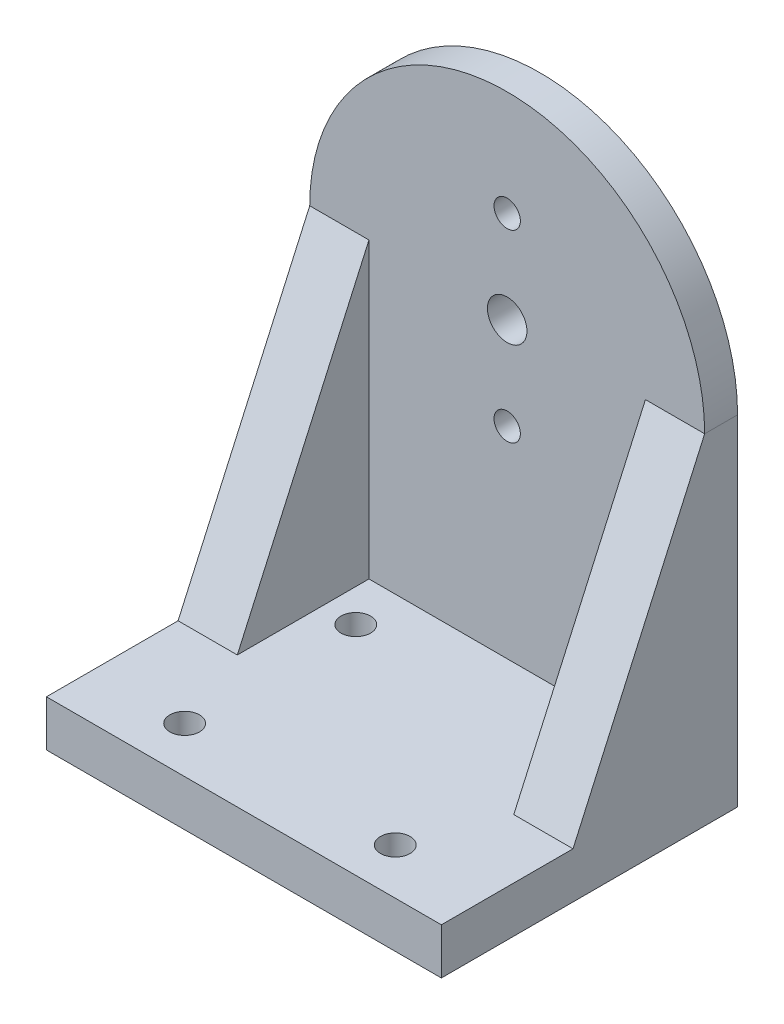
ISO-10303-21;
HEADER;
FILE_DESCRIPTION(('STEP AP214'),'2;1');
FILE_NAME('part.step','',(''),(''),'','','');
FILE_SCHEMA(('AUTOMOTIVE_DESIGN { 1 0 10303 214 1 1 1 1 }'));
ENDSEC;
DATA;
#1=APPLICATION_CONTEXT('core data for automotive mechanical design processes');
#2=APPLICATION_PROTOCOL_DEFINITION('international standard','automotive_design',2000,#1);
#3=PRODUCT_CONTEXT('',#1,'mechanical');
#4=PRODUCT('Part','Part','',(#3));
#5=PRODUCT_RELATED_PRODUCT_CATEGORY('part','',(#4));
#6=PRODUCT_DEFINITION_FORMATION('','',#4);
#7=PRODUCT_DEFINITION_CONTEXT('part definition',#1,'design');
#8=PRODUCT_DEFINITION('design','',#6,#7);
#9=PRODUCT_DEFINITION_SHAPE('','',#8);
#10=(LENGTH_UNIT() NAMED_UNIT(*) SI_UNIT(.MILLI.,.METRE.));
#11=(NAMED_UNIT(*) PLANE_ANGLE_UNIT() SI_UNIT($,.RADIAN.));
#12=(NAMED_UNIT(*) SI_UNIT($,.STERADIAN.) SOLID_ANGLE_UNIT());
#13=UNCERTAINTY_MEASURE_WITH_UNIT(LENGTH_MEASURE(1.E-05),#10,'distance_accuracy_value','');
#14=(GEOMETRIC_REPRESENTATION_CONTEXT(3) GLOBAL_UNCERTAINTY_ASSIGNED_CONTEXT((#13)) GLOBAL_UNIT_ASSIGNED_CONTEXT((#10,
#11,#12)) REPRESENTATION_CONTEXT('',''));
#15=CARTESIAN_POINT('',(0.,0.,0.));
#16=DIRECTION('',(0.,0.,1.));
#17=DIRECTION('',(1.,0.,0.));
#18=AXIS2_PLACEMENT_3D('',#15,#16,#17);
#19=CARTESIAN_POINT('',(0.,26.6,5.));
#20=DIRECTION('',(0.,0.,-1.));
#21=DIRECTION('',(-1.,0.,0.));
#22=AXIS2_PLACEMENT_3D('',#19,#20,#21);
#23=PLANE('',#22);
#24=CARTESIAN_POINT('',(0.,26.6,5.));
#25=DIRECTION('',(0.,0.,1.));
#26=DIRECTION('',(1.,0.,0.));
#27=AXIS2_PLACEMENT_3D('',#24,#25,#26);
#28=CIRCLE('',#27,3.);
#29=CARTESIAN_POINT('',(2.99999999999997,26.6,5.));
#30=VERTEX_POINT('',#29);
#31=EDGE_CURVE('E184',#30,#30,#28,.T.);
#32=ORIENTED_EDGE('',*,*,#31,.F.);
#33=EDGE_LOOP('',(#32));
#34=FACE_BOUND('',#33,.T.);
#35=CARTESIAN_POINT('',(0.,40.6,5.));
#36=DIRECTION('',(0.,0.,1.));
#37=DIRECTION('',(1.,0.,0.));
#38=AXIS2_PLACEMENT_3D('',#35,#36,#37);
#39=CIRCLE('',#38,2.);
#40=CARTESIAN_POINT('',(1.99999999999997,40.6,5.));
#41=VERTEX_POINT('',#40);
#42=EDGE_CURVE('E176',#41,#41,#39,.T.);
#43=ORIENTED_EDGE('',*,*,#42,.F.);
#44=EDGE_LOOP('',(#43));
#45=FACE_BOUND('',#44,.T.);
#46=CARTESIAN_POINT('',(0.,12.6,5.));
#47=DIRECTION('',(0.,0.,1.));
#48=DIRECTION('',(1.,0.,0.));
#49=AXIS2_PLACEMENT_3D('',#46,#47,#48);
#50=CIRCLE('',#49,2.);
#51=CARTESIAN_POINT('',(1.99999999999997,12.6,5.));
#52=VERTEX_POINT('',#51);
#53=EDGE_CURVE('E168',#52,#52,#50,.T.);
#54=ORIENTED_EDGE('',*,*,#53,.F.);
#55=EDGE_LOOP('',(#54));
#56=FACE_BOUND('',#55,.T.);
#57=DIRECTION('',(1.,0.,0.));
#58=VECTOR('',#57,1.);
#59=CARTESIAN_POINT('',(21.,26.6,5.));
#60=LINE('',#59,#58);
#61=CARTESIAN_POINT('',(21.,26.6,5.));
#62=VERTEX_POINT('',#61);
#63=CARTESIAN_POINT('',(30.,26.6,5.));
#64=VERTEX_POINT('',#63);
#65=EDGE_CURVE('E137',#62,#64,#60,.T.);
#66=ORIENTED_EDGE('',*,*,#65,.T.);
#67=CARTESIAN_POINT('',(0.,26.6,5.));
#68=DIRECTION('',(0.,0.,1.));
#69=DIRECTION('',(-1.,0.,0.));
#70=AXIS2_PLACEMENT_3D('',#67,#68,#69);
#71=CIRCLE('',#70,30.);
#72=CARTESIAN_POINT('',(-30.,26.6,5.));
#73=VERTEX_POINT('',#72);
#74=EDGE_CURVE('E192',#64,#73,#71,.T.);
#75=ORIENTED_EDGE('',*,*,#74,.T.);
#76=DIRECTION('',(-1.,0.,0.));
#77=VECTOR('',#76,1.);
#78=CARTESIAN_POINT('',(-21.,26.6,5.));
#79=LINE('',#78,#77);
#80=CARTESIAN_POINT('',(-21.,26.6,5.));
#81=VERTEX_POINT('',#80);
#82=EDGE_CURVE('E118',#81,#73,#79,.T.);
#83=ORIENTED_EDGE('',*,*,#82,.F.);
#84=DIRECTION('',(0.,-1.,0.));
#85=VECTOR('',#84,1.);
#86=CARTESIAN_POINT('',(-21.,-18.,5.));
#87=LINE('',#86,#85);
#88=CARTESIAN_POINT('',(-21.,-18.,5.));
#89=VERTEX_POINT('',#88);
#90=EDGE_CURVE('E123',#81,#89,#87,.T.);
#91=ORIENTED_EDGE('',*,*,#90,.T.);
#92=DIRECTION('',(-1.,0.,0.));
#93=VECTOR('',#92,1.);
#94=CARTESIAN_POINT('',(-30.,-18.,5.));
#95=LINE('',#94,#93);
#96=CARTESIAN_POINT('',(21.,-18.,5.));
#97=VERTEX_POINT('',#96);
#98=EDGE_CURVE('E109',#97,#89,#95,.T.);
#99=ORIENTED_EDGE('',*,*,#98,.F.);
#100=DIRECTION('',(0.,-1.,0.));
#101=VECTOR('',#100,1.);
#102=CARTESIAN_POINT('',(21.,-18.,5.));
#103=LINE('',#102,#101);
#104=EDGE_CURVE('E54',#62,#97,#103,.T.);
#105=ORIENTED_EDGE('',*,*,#104,.F.);
#106=EDGE_LOOP('',(#66,#75,#83,#91,#99,#105));
#107=FACE_BOUND('',#106,.T.);
#108=ADVANCED_FACE('F38',(#34,#45,#56,#107),#23,.F.);
#109=CARTESIAN_POINT('',(-30.,-18.,45.));
#110=DIRECTION('',(0.,-1.,0.));
#111=DIRECTION('',(0.,0.,-1.));
#112=AXIS2_PLACEMENT_3D('',#109,#110,#111);
#113=PLANE('',#112);
#114=CARTESIAN_POINT('',(16.,-18.,12.));
#115=DIRECTION('',(0.,1.,0.));
#116=DIRECTION('',(0.,0.,1.));
#117=AXIS2_PLACEMENT_3D('',#114,#115,#116);
#118=CIRCLE('',#117,2.25);
#119=CARTESIAN_POINT('',(16.,-18.,14.25));
#120=VERTEX_POINT('',#119);
#121=EDGE_CURVE('E306',#120,#120,#118,.T.);
#122=ORIENTED_EDGE('',*,*,#121,.F.);
#123=EDGE_LOOP('',(#122));
#124=FACE_BOUND('',#123,.T.);
#125=CARTESIAN_POINT('',(-16.,-18.,12.));
#126=DIRECTION('',(0.,1.,0.));
#127=DIRECTION('',(0.,0.,1.));
#128=AXIS2_PLACEMENT_3D('',#125,#126,#127);
#129=CIRCLE('',#128,2.25);
#130=CARTESIAN_POINT('',(-16.,-18.,14.25));
#131=VERTEX_POINT('',#130);
#132=EDGE_CURVE('E314',#131,#131,#129,.T.);
#133=ORIENTED_EDGE('',*,*,#132,.F.);
#134=EDGE_LOOP('',(#133));
#135=FACE_BOUND('',#134,.T.);
#136=CARTESIAN_POINT('',(-16.,-18.,38.));
#137=DIRECTION('',(0.,1.,0.));
#138=DIRECTION('',(0.,0.,1.));
#139=AXIS2_PLACEMENT_3D('',#136,#137,#138);
#140=CIRCLE('',#139,2.25);
#141=CARTESIAN_POINT('',(-16.,-18.,40.25));
#142=VERTEX_POINT('',#141);
#143=EDGE_CURVE('E322',#142,#142,#140,.T.);
#144=ORIENTED_EDGE('',*,*,#143,.F.);
#145=EDGE_LOOP('',(#144));
#146=FACE_BOUND('',#145,.T.);
#147=CARTESIAN_POINT('',(16.,-18.,38.));
#148=DIRECTION('',(0.,1.,0.));
#149=DIRECTION('',(0.,0.,1.));
#150=AXIS2_PLACEMENT_3D('',#147,#148,#149);
#151=CIRCLE('',#150,2.25);
#152=CARTESIAN_POINT('',(16.,-18.,40.25));
#153=VERTEX_POINT('',#152);
#154=EDGE_CURVE('E292',#153,#153,#151,.T.);
#155=ORIENTED_EDGE('',*,*,#154,.F.);
#156=EDGE_LOOP('',(#155));
#157=FACE_BOUND('',#156,.T.);
#158=DIRECTION('',(1.,0.,0.));
#159=VECTOR('',#158,1.);
#160=CARTESIAN_POINT('',(21.,-18.,25.));
#161=LINE('',#160,#159);
#162=CARTESIAN_POINT('',(21.,-18.,25.));
#163=VERTEX_POINT('',#162);
#164=CARTESIAN_POINT('',(30.,-18.,25.));
#165=VERTEX_POINT('',#164);
#166=EDGE_CURVE('E62',#163,#165,#161,.T.);
#167=ORIENTED_EDGE('',*,*,#166,.F.);
#168=DIRECTION('',(0.,0.,1.));
#169=VECTOR('',#168,1.);
#170=CARTESIAN_POINT('',(21.,-18.,25.));
#171=LINE('',#170,#169);
#172=EDGE_CURVE('E114',#97,#163,#171,.T.);
#173=ORIENTED_EDGE('',*,*,#172,.F.);
#174=ORIENTED_EDGE('',*,*,#98,.T.);
#175=DIRECTION('',(0.,0.,1.));
#176=VECTOR('',#175,1.);
#177=CARTESIAN_POINT('',(-21.,-18.,25.));
#178=LINE('',#177,#176);
#179=CARTESIAN_POINT('',(-21.,-18.,25.));
#180=VERTEX_POINT('',#179);
#181=EDGE_CURVE('E113',#89,#180,#178,.T.);
#182=ORIENTED_EDGE('',*,*,#181,.T.);
#183=DIRECTION('',(-1.,0.,0.));
#184=VECTOR('',#183,1.);
#185=CARTESIAN_POINT('',(-21.,-18.,25.));
#186=LINE('',#185,#184);
#187=CARTESIAN_POINT('',(-30.,-18.,25.));
#188=VERTEX_POINT('',#187);
#189=EDGE_CURVE('E141',#180,#188,#186,.T.);
#190=ORIENTED_EDGE('',*,*,#189,.T.);
#191=DIRECTION('',(0.,0.,-1.));
#192=VECTOR('',#191,1.);
#193=CARTESIAN_POINT('',(-30.,-18.,45.));
#194=LINE('',#193,#192);
#195=CARTESIAN_POINT('',(-30.,-18.,45.));
#196=VERTEX_POINT('',#195);
#197=EDGE_CURVE('E159',#196,#188,#194,.T.);
#198=ORIENTED_EDGE('',*,*,#197,.F.);
#199=DIRECTION('',(-1.,0.,0.));
#200=VECTOR('',#199,1.);
#201=CARTESIAN_POINT('',(-30.,-18.,45.));
#202=LINE('',#201,#200);
#203=CARTESIAN_POINT('',(30.,-18.,45.));
#204=VERTEX_POINT('',#203);
#205=EDGE_CURVE('E157',#204,#196,#202,.T.);
#206=ORIENTED_EDGE('',*,*,#205,.F.);
#207=DIRECTION('',(0.,0.,-1.));
#208=VECTOR('',#207,1.);
#209=CARTESIAN_POINT('',(30.,-18.,45.));
#210=LINE('',#209,#208);
#211=EDGE_CURVE('E164',#204,#165,#210,.T.);
#212=ORIENTED_EDGE('',*,*,#211,.T.);
#213=EDGE_LOOP('',(#167,#173,#174,#182,#190,#198,#206,#212));
#214=FACE_BOUND('',#213,.T.);
#215=ADVANCED_FACE('F111',(#124,#135,#146,#157,#214),#113,.F.);
#216=CARTESIAN_POINT('',(0.,26.6,0.));
#217=DIRECTION('',(0.,0.,-1.));
#218=DIRECTION('',(-1.,0.,0.));
#219=AXIS2_PLACEMENT_3D('',#216,#217,#218);
#220=PLANE('',#219);
#221=CARTESIAN_POINT('',(0.,40.6,0.));
#222=DIRECTION('',(0.,0.,1.));
#223=DIRECTION('',(1.,0.,0.));
#224=AXIS2_PLACEMENT_3D('',#221,#222,#223);
#225=CIRCLE('',#224,2.);
#226=CARTESIAN_POINT('',(1.99999999999997,40.6,0.));
#227=VERTEX_POINT('',#226);
#228=EDGE_CURVE('E172',#227,#227,#225,.T.);
#229=ORIENTED_EDGE('',*,*,#228,.T.);
#230=EDGE_LOOP('',(#229));
#231=FACE_BOUND('',#230,.T.);
#232=DIRECTION('',(0.,1.,0.));
#233=VECTOR('',#232,1.);
#234=CARTESIAN_POINT('',(30.,26.6,0.));
#235=LINE('',#234,#233);
#236=CARTESIAN_POINT('',(30.,-25.,0.));
#237=VERTEX_POINT('',#236);
#238=CARTESIAN_POINT('',(30.,26.6,0.));
#239=VERTEX_POINT('',#238);
#240=EDGE_CURVE('E188',#237,#239,#235,.T.);
#241=ORIENTED_EDGE('',*,*,#240,.F.);
#242=DIRECTION('',(1.,0.,0.));
#243=VECTOR('',#242,1.);
#244=CARTESIAN_POINT('',(-30.,-25.,0.));
#245=LINE('',#244,#243);
#246=CARTESIAN_POINT('',(-30.,-25.,0.));
#247=VERTEX_POINT('',#246);
#248=EDGE_CURVE('E196',#247,#237,#245,.T.);
#249=ORIENTED_EDGE('',*,*,#248,.F.);
#250=DIRECTION('',(0.,-1.,0.));
#251=VECTOR('',#250,1.);
#252=CARTESIAN_POINT('',(-30.,26.6,0.));
#253=LINE('',#252,#251);
#254=CARTESIAN_POINT('',(-30.,26.6,0.));
#255=VERTEX_POINT('',#254);
#256=EDGE_CURVE('E203',#255,#247,#253,.T.);
#257=ORIENTED_EDGE('',*,*,#256,.F.);
#258=CARTESIAN_POINT('',(0.,26.6,0.));
#259=DIRECTION('',(0.,0.,1.));
#260=DIRECTION('',(-1.,0.,0.));
#261=AXIS2_PLACEMENT_3D('',#258,#259,#260);
#262=CIRCLE('',#261,30.);
#263=EDGE_CURVE('E200',#239,#255,#262,.T.);
#264=ORIENTED_EDGE('',*,*,#263,.F.);
#265=EDGE_LOOP('',(#241,#249,#257,#264));
#266=FACE_BOUND('',#265,.T.);
#267=CARTESIAN_POINT('',(0.,26.6,0.));
#268=DIRECTION('',(0.,0.,1.));
#269=DIRECTION('',(1.,0.,0.));
#270=AXIS2_PLACEMENT_3D('',#267,#268,#269);
#271=CIRCLE('',#270,3.);
#272=CARTESIAN_POINT('',(2.99999999999997,26.6,0.));
#273=VERTEX_POINT('',#272);
#274=EDGE_CURVE('E180',#273,#273,#271,.T.);
#275=ORIENTED_EDGE('',*,*,#274,.T.);
#276=EDGE_LOOP('',(#275));
#277=FACE_BOUND('',#276,.T.);
#278=CARTESIAN_POINT('',(0.,12.6,0.));
#279=DIRECTION('',(0.,0.,1.));
#280=DIRECTION('',(1.,0.,0.));
#281=AXIS2_PLACEMENT_3D('',#278,#279,#280);
#282=CIRCLE('',#281,2.);
#283=CARTESIAN_POINT('',(1.99999999999997,12.6,0.));
#284=VERTEX_POINT('',#283);
#285=EDGE_CURVE('E167',#284,#284,#282,.T.);
#286=ORIENTED_EDGE('',*,*,#285,.T.);
#287=EDGE_LOOP('',(#286));
#288=FACE_BOUND('',#287,.T.);
#289=ADVANCED_FACE('F225',(#231,#266,#277,#288),#220,.T.);
#290=CARTESIAN_POINT('',(30.,26.6,5.));
#291=DIRECTION('',(-1.,0.,0.));
#292=DIRECTION('',(0.,-1.,0.));
#293=AXIS2_PLACEMENT_3D('',#290,#291,#292);
#294=PLANE('',#293);
#295=DIRECTION('',(0.,0.,-1.));
#296=VECTOR('',#295,1.);
#297=CARTESIAN_POINT('',(30.,26.6,5.));
#298=LINE('',#297,#296);
#299=EDGE_CURVE('E11',#64,#239,#298,.T.);
#300=ORIENTED_EDGE('',*,*,#299,.F.);
#301=DIRECTION('',(0.,0.912456651070453,-0.409173386130248));
#302=VECTOR('',#301,1.);
#303=CARTESIAN_POINT('',(30.,26.6,5.));
#304=LINE('',#303,#302);
#305=EDGE_CURVE('E280',#165,#64,#304,.T.);
#306=ORIENTED_EDGE('',*,*,#305,.F.);
#307=ORIENTED_EDGE('',*,*,#211,.F.);
#308=DIRECTION('',(0.,1.,0.));
#309=VECTOR('',#308,1.);
#310=CARTESIAN_POINT('',(30.,-25.,45.));
#311=LINE('',#310,#309);
#312=CARTESIAN_POINT('',(30.,-25.,45.));
#313=VERTEX_POINT('',#312);
#314=EDGE_CURVE('E154',#313,#204,#311,.T.);
#315=ORIENTED_EDGE('',*,*,#314,.F.);
#316=DIRECTION('',(0.,0.,-1.));
#317=VECTOR('',#316,1.);
#318=CARTESIAN_POINT('',(30.,-25.,5.));
#319=LINE('',#318,#317);
#320=EDGE_CURVE('E195',#313,#237,#319,.T.);
#321=ORIENTED_EDGE('',*,*,#320,.T.);
#322=ORIENTED_EDGE('',*,*,#240,.T.);
#323=EDGE_LOOP('',(#300,#306,#307,#315,#321,#322));
#324=FACE_BOUND('',#323,.T.);
#325=ADVANCED_FACE('F40',(#324),#294,.F.);
#326=CARTESIAN_POINT('',(0.,26.6,5.));
#327=DIRECTION('',(0.,0.,-1.));
#328=DIRECTION('',(-1.,0.,0.));
#329=AXIS2_PLACEMENT_3D('',#326,#327,#328);
#330=CYLINDRICAL_SURFACE('',#329,30.);
#331=ORIENTED_EDGE('',*,*,#263,.T.);
#332=DIRECTION('',(0.,0.,-1.));
#333=VECTOR('',#332,1.);
#334=CARTESIAN_POINT('',(-30.,26.6,5.));
#335=LINE('',#334,#333);
#336=EDGE_CURVE('E47',#73,#255,#335,.T.);
#337=ORIENTED_EDGE('',*,*,#336,.F.);
#338=ORIENTED_EDGE('',*,*,#74,.F.);
#339=ORIENTED_EDGE('',*,*,#299,.T.);
#340=EDGE_LOOP('',(#331,#337,#338,#339));
#341=FACE_BOUND('',#340,.T.);
#342=ADVANCED_FACE('F274',(#341),#330,.T.);
#343=CARTESIAN_POINT('',(-30.,26.6,5.));
#344=DIRECTION('',(1.,0.,0.));
#345=DIRECTION('',(0.,1.,0.));
#346=AXIS2_PLACEMENT_3D('',#343,#344,#345);
#347=PLANE('',#346);
#348=ORIENTED_EDGE('',*,*,#256,.T.);
#349=DIRECTION('',(0.,0.,-1.));
#350=VECTOR('',#349,1.);
#351=CARTESIAN_POINT('',(-30.,-25.,5.));
#352=LINE('',#351,#350);
#353=CARTESIAN_POINT('',(-30.,-25.,45.));
#354=VERTEX_POINT('',#353);
#355=EDGE_CURVE('E211',#354,#247,#352,.T.);
#356=ORIENTED_EDGE('',*,*,#355,.F.);
#357=DIRECTION('',(0.,-1.,0.));
#358=VECTOR('',#357,1.);
#359=CARTESIAN_POINT('',(-30.,-25.,45.));
#360=LINE('',#359,#358);
#361=EDGE_CURVE('E117',#196,#354,#360,.T.);
#362=ORIENTED_EDGE('',*,*,#361,.F.);
#363=ORIENTED_EDGE('',*,*,#197,.T.);
#364=DIRECTION('',(0.,0.912456651070453,-0.409173386130248));
#365=VECTOR('',#364,1.);
#366=CARTESIAN_POINT('',(-30.,26.6,5.));
#367=LINE('',#366,#365);
#368=EDGE_CURVE('E131',#188,#73,#367,.T.);
#369=ORIENTED_EDGE('',*,*,#368,.T.);
#370=ORIENTED_EDGE('',*,*,#336,.T.);
#371=EDGE_LOOP('',(#348,#356,#362,#363,#369,#370));
#372=FACE_BOUND('',#371,.T.);
#373=ADVANCED_FACE('F219',(#372),#347,.F.);
#374=CARTESIAN_POINT('',(-30.,-25.,5.));
#375=DIRECTION('',(0.,1.,0.));
#376=DIRECTION('',(0.,0.,1.));
#377=AXIS2_PLACEMENT_3D('',#374,#375,#376);
#378=PLANE('',#377);
#379=CARTESIAN_POINT('',(16.,-25.,12.));
#380=DIRECTION('',(0.,1.,0.));
#381=DIRECTION('',(0.,0.,1.));
#382=AXIS2_PLACEMENT_3D('',#379,#380,#381);
#383=CIRCLE('',#382,2.25);
#384=CARTESIAN_POINT('',(16.,-25.,14.25));
#385=VERTEX_POINT('',#384);
#386=EDGE_CURVE('E310',#385,#385,#383,.T.);
#387=ORIENTED_EDGE('',*,*,#386,.T.);
#388=EDGE_LOOP('',(#387));
#389=FACE_BOUND('',#388,.T.);
#390=CARTESIAN_POINT('',(-16.,-25.,12.));
#391=DIRECTION('',(0.,1.,0.));
#392=DIRECTION('',(0.,0.,1.));
#393=AXIS2_PLACEMENT_3D('',#390,#391,#392);
#394=CIRCLE('',#393,2.25);
#395=CARTESIAN_POINT('',(-16.,-25.,14.25));
#396=VERTEX_POINT('',#395);
#397=EDGE_CURVE('E318',#396,#396,#394,.T.);
#398=ORIENTED_EDGE('',*,*,#397,.T.);
#399=EDGE_LOOP('',(#398));
#400=FACE_BOUND('',#399,.T.);
#401=CARTESIAN_POINT('',(-16.,-25.,38.));
#402=DIRECTION('',(0.,1.,0.));
#403=DIRECTION('',(0.,0.,1.));
#404=AXIS2_PLACEMENT_3D('',#401,#402,#403);
#405=CIRCLE('',#404,2.25);
#406=CARTESIAN_POINT('',(-16.,-25.,40.25));
#407=VERTEX_POINT('',#406);
#408=EDGE_CURVE('E304',#407,#407,#405,.T.);
#409=ORIENTED_EDGE('',*,*,#408,.T.);
#410=EDGE_LOOP('',(#409));
#411=FACE_BOUND('',#410,.T.);
#412=CARTESIAN_POINT('',(16.,-25.,38.));
#413=DIRECTION('',(0.,1.,0.));
#414=DIRECTION('',(0.,0.,1.));
#415=AXIS2_PLACEMENT_3D('',#412,#413,#414);
#416=CIRCLE('',#415,2.25);
#417=CARTESIAN_POINT('',(16.,-25.,40.25));
#418=VERTEX_POINT('',#417);
#419=EDGE_CURVE('E285',#418,#418,#416,.T.);
#420=ORIENTED_EDGE('',*,*,#419,.T.);
#421=EDGE_LOOP('',(#420));
#422=FACE_BOUND('',#421,.T.);
#423=ORIENTED_EDGE('',*,*,#248,.T.);
#424=ORIENTED_EDGE('',*,*,#320,.F.);
#425=DIRECTION('',(1.,0.,0.));
#426=VECTOR('',#425,1.);
#427=CARTESIAN_POINT('',(-30.,-25.,45.));
#428=LINE('',#427,#426);
#429=EDGE_CURVE('E150',#354,#313,#428,.T.);
#430=ORIENTED_EDGE('',*,*,#429,.F.);
#431=ORIENTED_EDGE('',*,*,#355,.T.);
#432=EDGE_LOOP('',(#423,#424,#430,#431));
#433=FACE_BOUND('',#432,.T.);
#434=ADVANCED_FACE('F228',(#389,#400,#411,#422,#433),#378,.F.);
#435=CARTESIAN_POINT('',(0.,26.6,5.));
#436=DIRECTION('',(0.,0.,-1.));
#437=DIRECTION('',(-1.,0.,0.));
#438=AXIS2_PLACEMENT_3D('',#435,#436,#437);
#439=CYLINDRICAL_SURFACE('',#438,3.);
#440=ORIENTED_EDGE('',*,*,#31,.T.);
#441=EDGE_LOOP('',(#440));
#442=FACE_BOUND('',#441,.T.);
#443=ORIENTED_EDGE('',*,*,#274,.F.);
#444=EDGE_LOOP('',(#443));
#445=FACE_BOUND('',#444,.T.);
#446=ADVANCED_FACE('F265',(#442,#445),#439,.F.);
#447=CARTESIAN_POINT('',(0.,40.6,5.));
#448=DIRECTION('',(0.,0.,-1.));
#449=DIRECTION('',(-1.,0.,0.));
#450=AXIS2_PLACEMENT_3D('',#447,#448,#449);
#451=CYLINDRICAL_SURFACE('',#450,2.);
#452=ORIENTED_EDGE('',*,*,#42,.T.);
#453=EDGE_LOOP('',(#452));
#454=FACE_BOUND('',#453,.T.);
#455=ORIENTED_EDGE('',*,*,#228,.F.);
#456=EDGE_LOOP('',(#455));
#457=FACE_BOUND('',#456,.T.);
#458=ADVANCED_FACE('F421',(#454,#457),#451,.F.);
#459=CARTESIAN_POINT('',(0.,12.6,5.));
#460=DIRECTION('',(0.,0.,-1.));
#461=DIRECTION('',(-1.,0.,0.));
#462=AXIS2_PLACEMENT_3D('',#459,#460,#461);
#463=CYLINDRICAL_SURFACE('',#462,2.);
#464=ORIENTED_EDGE('',*,*,#53,.T.);
#465=EDGE_LOOP('',(#464));
#466=FACE_BOUND('',#465,.T.);
#467=ORIENTED_EDGE('',*,*,#285,.F.);
#468=EDGE_LOOP('',(#467));
#469=FACE_BOUND('',#468,.T.);
#470=ADVANCED_FACE('F250',(#466,#469),#463,.F.);
#471=CARTESIAN_POINT('',(0.,0.,45.));
#472=DIRECTION('',(0.,0.,-1.));
#473=DIRECTION('',(-1.,0.,0.));
#474=AXIS2_PLACEMENT_3D('',#471,#472,#473);
#475=PLANE('',#474);
#476=ORIENTED_EDGE('',*,*,#361,.T.);
#477=ORIENTED_EDGE('',*,*,#429,.T.);
#478=ORIENTED_EDGE('',*,*,#314,.T.);
#479=ORIENTED_EDGE('',*,*,#205,.T.);
#480=EDGE_LOOP('',(#476,#477,#478,#479));
#481=FACE_BOUND('',#480,.T.);
#482=ADVANCED_FACE('F237',(#481),#475,.F.);
#483=CARTESIAN_POINT('',(-21.,26.6,5.));
#484=DIRECTION('',(0.,0.409173386130248,0.912456651070453));
#485=DIRECTION('',(0.,-0.912456651070453,0.409173386130248));
#486=AXIS2_PLACEMENT_3D('',#483,#484,#485);
#487=PLANE('',#486);
#488=ORIENTED_EDGE('',*,*,#368,.F.);
#489=ORIENTED_EDGE('',*,*,#189,.F.);
#490=DIRECTION('',(0.,0.912456651070453,-0.409173386130248));
#491=VECTOR('',#490,1.);
#492=CARTESIAN_POINT('',(-21.,26.6,5.));
#493=LINE('',#492,#491);
#494=EDGE_CURVE('E125',#180,#81,#493,.T.);
#495=ORIENTED_EDGE('',*,*,#494,.T.);
#496=ORIENTED_EDGE('',*,*,#82,.T.);
#497=EDGE_LOOP('',(#488,#489,#495,#496));
#498=FACE_BOUND('',#497,.T.);
#499=ADVANCED_FACE('F241',(#498),#487,.T.);
#500=CARTESIAN_POINT('',(-21.,0.,0.));
#501=DIRECTION('',(-1.,0.,0.));
#502=DIRECTION('',(0.,-1.,0.));
#503=AXIS2_PLACEMENT_3D('',#500,#501,#502);
#504=PLANE('',#503);
#505=ORIENTED_EDGE('',*,*,#90,.F.);
#506=ORIENTED_EDGE('',*,*,#494,.F.);
#507=ORIENTED_EDGE('',*,*,#181,.F.);
#508=EDGE_LOOP('',(#505,#506,#507));
#509=FACE_BOUND('',#508,.T.);
#510=ADVANCED_FACE('F122',(#509),#504,.F.);
#511=CARTESIAN_POINT('',(21.,26.6,5.));
#512=DIRECTION('',(0.,-0.409173386130248,-0.912456651070453));
#513=DIRECTION('',(0.,0.912456651070453,-0.409173386130248));
#514=AXIS2_PLACEMENT_3D('',#511,#512,#513);
#515=PLANE('',#514);
#516=ORIENTED_EDGE('',*,*,#305,.T.);
#517=ORIENTED_EDGE('',*,*,#65,.F.);
#518=DIRECTION('',(0.,0.912456651070453,-0.409173386130248));
#519=VECTOR('',#518,1.);
#520=CARTESIAN_POINT('',(21.,26.6,5.));
#521=LINE('',#520,#519);
#522=EDGE_CURVE('E289',#163,#62,#521,.T.);
#523=ORIENTED_EDGE('',*,*,#522,.F.);
#524=ORIENTED_EDGE('',*,*,#166,.T.);
#525=EDGE_LOOP('',(#516,#517,#523,#524));
#526=FACE_BOUND('',#525,.T.);
#527=ADVANCED_FACE('F248',(#526),#515,.F.);
#528=CARTESIAN_POINT('',(21.,0.,0.));
#529=DIRECTION('',(1.,0.,0.));
#530=DIRECTION('',(0.,-1.,0.));
#531=AXIS2_PLACEMENT_3D('',#528,#529,#530);
#532=PLANE('',#531);
#533=ORIENTED_EDGE('',*,*,#104,.T.);
#534=ORIENTED_EDGE('',*,*,#172,.T.);
#535=ORIENTED_EDGE('',*,*,#522,.T.);
#536=EDGE_LOOP('',(#533,#534,#535));
#537=FACE_BOUND('',#536,.T.);
#538=ADVANCED_FACE('F344',(#537),#532,.F.);
#539=CARTESIAN_POINT('',(16.,-25.,38.));
#540=DIRECTION('',(0.,1.,0.));
#541=DIRECTION('',(0.,0.,1.));
#542=AXIS2_PLACEMENT_3D('',#539,#540,#541);
#543=CYLINDRICAL_SURFACE('',#542,2.25);
#544=ORIENTED_EDGE('',*,*,#419,.F.);
#545=EDGE_LOOP('',(#544));
#546=FACE_BOUND('',#545,.T.);
#547=ORIENTED_EDGE('',*,*,#154,.T.);
#548=EDGE_LOOP('',(#547));
#549=FACE_BOUND('',#548,.T.);
#550=ADVANCED_FACE('F336',(#546,#549),#543,.F.);
#551=CARTESIAN_POINT('',(-16.,-25.,38.));
#552=DIRECTION('',(0.,1.,0.));
#553=DIRECTION('',(0.,0.,1.));
#554=AXIS2_PLACEMENT_3D('',#551,#552,#553);
#555=CYLINDRICAL_SURFACE('',#554,2.25);
#556=ORIENTED_EDGE('',*,*,#408,.F.);
#557=EDGE_LOOP('',(#556));
#558=FACE_BOUND('',#557,.T.);
#559=ORIENTED_EDGE('',*,*,#143,.T.);
#560=EDGE_LOOP('',(#559));
#561=FACE_BOUND('',#560,.T.);
#562=ADVANCED_FACE('F332',(#558,#561),#555,.F.);
#563=CARTESIAN_POINT('',(-16.,-25.,12.));
#564=DIRECTION('',(0.,1.,0.));
#565=DIRECTION('',(0.,0.,1.));
#566=AXIS2_PLACEMENT_3D('',#563,#564,#565);
#567=CYLINDRICAL_SURFACE('',#566,2.25);
#568=ORIENTED_EDGE('',*,*,#397,.F.);
#569=EDGE_LOOP('',(#568));
#570=FACE_BOUND('',#569,.T.);
#571=ORIENTED_EDGE('',*,*,#132,.T.);
#572=EDGE_LOOP('',(#571));
#573=FACE_BOUND('',#572,.T.);
#574=ADVANCED_FACE('F335',(#570,#573),#567,.F.);
#575=CARTESIAN_POINT('',(16.,-25.,12.));
#576=DIRECTION('',(0.,1.,0.));
#577=DIRECTION('',(0.,0.,1.));
#578=AXIS2_PLACEMENT_3D('',#575,#576,#577);
#579=CYLINDRICAL_SURFACE('',#578,2.25);
#580=ORIENTED_EDGE('',*,*,#386,.F.);
#581=EDGE_LOOP('',(#580));
#582=FACE_BOUND('',#581,.T.);
#583=ORIENTED_EDGE('',*,*,#121,.T.);
#584=EDGE_LOOP('',(#583));
#585=FACE_BOUND('',#584,.T.);
#586=ADVANCED_FACE('F353',(#582,#585),#579,.F.);
#587=CLOSED_SHELL('',(#108,#215,#289,#325,#342,#373,#434,#446,#458,#470,#482,#499,#510,#527,
#538,#550,#562,#574,#586));
#588=MANIFOLD_SOLID_BREP('B2',#587);
#589=ADVANCED_BREP_SHAPE_REPRESENTATION('',(#18,#588),#14);
#590=SHAPE_DEFINITION_REPRESENTATION(#9,#589);
ENDSEC;
END-ISO-10303-21;
